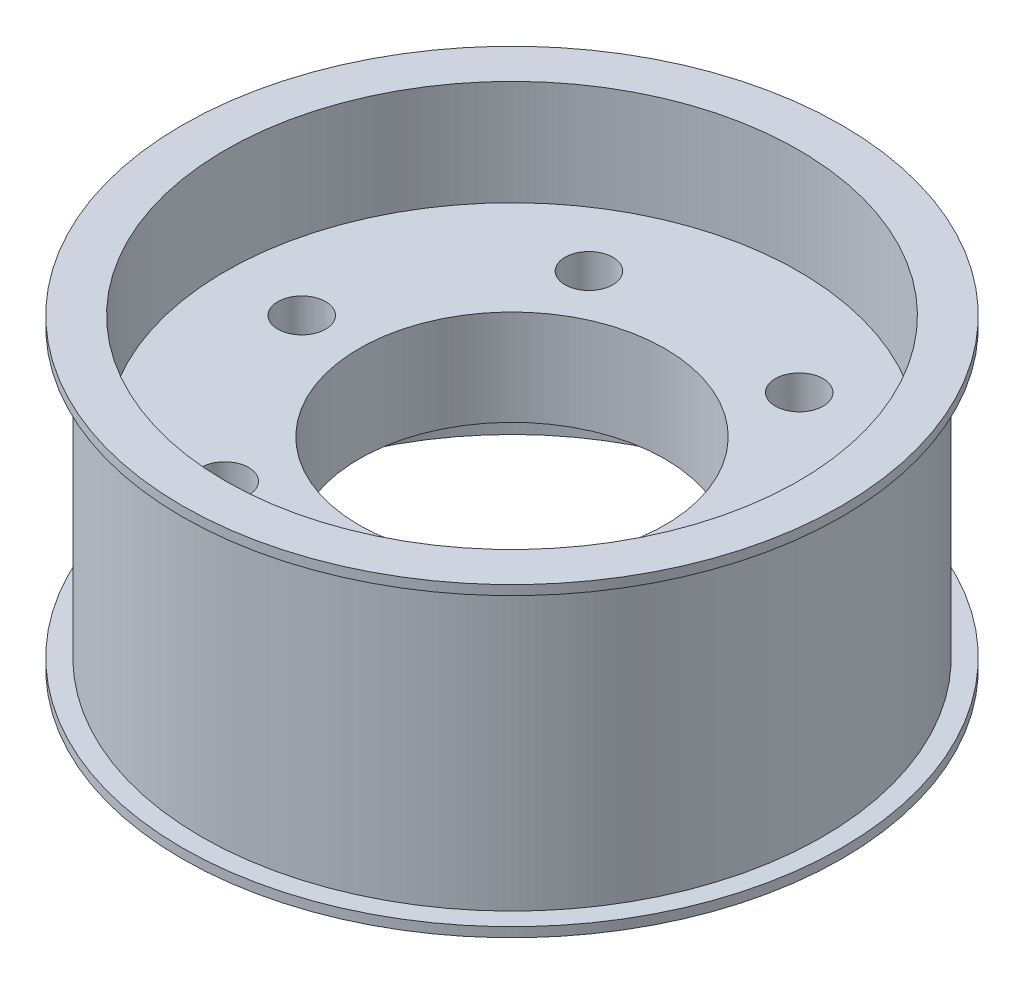
ISO-10303-21;
HEADER;
FILE_DESCRIPTION(('STEP AP214'),'2;1');
FILE_NAME('part.step','',(''),(''),'','','');
FILE_SCHEMA(('AUTOMOTIVE_DESIGN { 1 0 10303 214 1 1 1 1 }'));
ENDSEC;
DATA;
#1=APPLICATION_CONTEXT('core data for automotive mechanical design processes');
#2=APPLICATION_PROTOCOL_DEFINITION('international standard','automotive_design',2000,#1);
#3=PRODUCT_CONTEXT('',#1,'mechanical');
#4=PRODUCT('Part','Part','',(#3));
#5=PRODUCT_RELATED_PRODUCT_CATEGORY('part','',(#4));
#6=PRODUCT_DEFINITION_FORMATION('','',#4);
#7=PRODUCT_DEFINITION_CONTEXT('part definition',#1,'design');
#8=PRODUCT_DEFINITION('design','',#6,#7);
#9=PRODUCT_DEFINITION_SHAPE('','',#8);
#10=(LENGTH_UNIT() NAMED_UNIT(*) SI_UNIT(.MILLI.,.METRE.));
#11=(NAMED_UNIT(*) PLANE_ANGLE_UNIT() SI_UNIT($,.RADIAN.));
#12=(NAMED_UNIT(*) SI_UNIT($,.STERADIAN.) SOLID_ANGLE_UNIT());
#13=UNCERTAINTY_MEASURE_WITH_UNIT(LENGTH_MEASURE(1.E-05),#10,'distance_accuracy_value','');
#14=(GEOMETRIC_REPRESENTATION_CONTEXT(3) GLOBAL_UNCERTAINTY_ASSIGNED_CONTEXT((#13)) GLOBAL_UNIT_ASSIGNED_CONTEXT((#10,
#11,#12)) REPRESENTATION_CONTEXT('',''));
#15=CARTESIAN_POINT('',(0.,0.,0.));
#16=DIRECTION('',(0.,0.,1.));
#17=DIRECTION('',(1.,0.,0.));
#18=AXIS2_PLACEMENT_3D('',#15,#16,#17);
#19=CARTESIAN_POINT('',(17.25,-7.5,0.));
#20=DIRECTION('',(0.,-1.,0.));
#21=DIRECTION('',(0.,0.,-1.));
#22=AXIS2_PLACEMENT_3D('',#19,#20,#21);
#23=PLANE('',#22);
#24=CARTESIAN_POINT('',(0.,-7.5,0.));
#25=DIRECTION('',(0.,1.,0.));
#26=DIRECTION('',(0.,0.,1.));
#27=AXIS2_PLACEMENT_3D('',#24,#25,#26);
#28=CIRCLE('',#27,16.25);
#29=CARTESIAN_POINT('',(0.,-7.5,16.25));
#30=VERTEX_POINT('',#29);
#31=EDGE_CURVE('E10',#30,#30,#28,.T.);
#32=ORIENTED_EDGE('',*,*,#31,.F.);
#33=EDGE_LOOP('',(#32));
#34=FACE_BOUND('',#33,.T.);
#35=CARTESIAN_POINT('',(0.,-7.5,0.));
#36=DIRECTION('',(0.,1.,0.));
#37=DIRECTION('',(0.,0.,1.));
#38=AXIS2_PLACEMENT_3D('',#35,#36,#37);
#39=CIRCLE('',#38,17.25);
#40=CARTESIAN_POINT('',(0.,-7.5,17.25));
#41=VERTEX_POINT('',#40);
#42=EDGE_CURVE('E100',#41,#41,#39,.T.);
#43=ORIENTED_EDGE('',*,*,#42,.T.);
#44=EDGE_LOOP('',(#43));
#45=FACE_BOUND('',#44,.T.);
#46=ADVANCED_FACE('F37',(#34,#45),#23,.F.);
#47=CARTESIAN_POINT('',(0.,8.98299078667611,0.));
#48=DIRECTION('',(0.,1.,0.));
#49=DIRECTION('',(0.,0.,1.));
#50=AXIS2_PLACEMENT_3D('',#47,#48,#49);
#51=CYLINDRICAL_SURFACE('',#50,16.25);
#52=CARTESIAN_POINT('',(0.,7.5,0.));
#53=DIRECTION('',(0.,1.,0.));
#54=DIRECTION('',(0.,0.,1.));
#55=AXIS2_PLACEMENT_3D('',#52,#53,#54);
#56=CIRCLE('',#55,16.25);
#57=CARTESIAN_POINT('',(0.,7.5,16.25));
#58=VERTEX_POINT('',#57);
#59=EDGE_CURVE('E45',#58,#58,#56,.T.);
#60=ORIENTED_EDGE('',*,*,#59,.F.);
#61=EDGE_LOOP('',(#60));
#62=FACE_BOUND('',#61,.T.);
#63=ORIENTED_EDGE('',*,*,#31,.T.);
#64=EDGE_LOOP('',(#63));
#65=FACE_BOUND('',#64,.T.);
#66=ADVANCED_FACE('F136',(#62,#65),#51,.T.);
#67=CARTESIAN_POINT('',(17.25,7.5,0.));
#68=DIRECTION('',(0.,1.,0.));
#69=DIRECTION('',(0.,0.,1.));
#70=AXIS2_PLACEMENT_3D('',#67,#68,#69);
#71=PLANE('',#70);
#72=CARTESIAN_POINT('',(0.,7.5,0.));
#73=DIRECTION('',(0.,1.,0.));
#74=DIRECTION('',(0.,0.,1.));
#75=AXIS2_PLACEMENT_3D('',#72,#73,#74);
#76=CIRCLE('',#75,17.25);
#77=CARTESIAN_POINT('',(0.,7.5,17.25));
#78=VERTEX_POINT('',#77);
#79=EDGE_CURVE('E51',#78,#78,#76,.T.);
#80=ORIENTED_EDGE('',*,*,#79,.F.);
#81=EDGE_LOOP('',(#80));
#82=FACE_BOUND('',#81,.T.);
#83=ORIENTED_EDGE('',*,*,#59,.T.);
#84=EDGE_LOOP('',(#83));
#85=FACE_BOUND('',#84,.T.);
#86=ADVANCED_FACE('F133',(#82,#85),#71,.F.);
#87=CARTESIAN_POINT('',(0.,8.98299078667611,0.));
#88=DIRECTION('',(0.,1.,0.));
#89=DIRECTION('',(0.,0.,1.));
#90=AXIS2_PLACEMENT_3D('',#87,#88,#89);
#91=CYLINDRICAL_SURFACE('',#90,17.25);
#92=CARTESIAN_POINT('',(0.,8.,0.));
#93=DIRECTION('',(0.,1.,0.));
#94=DIRECTION('',(0.,0.,1.));
#95=AXIS2_PLACEMENT_3D('',#92,#93,#94);
#96=CIRCLE('',#95,17.25);
#97=CARTESIAN_POINT('',(0.,8.,17.25));
#98=VERTEX_POINT('',#97);
#99=EDGE_CURVE('E124',#98,#98,#96,.T.);
#100=ORIENTED_EDGE('',*,*,#99,.F.);
#101=EDGE_LOOP('',(#100));
#102=FACE_BOUND('',#101,.T.);
#103=ORIENTED_EDGE('',*,*,#79,.T.);
#104=EDGE_LOOP('',(#103));
#105=FACE_BOUND('',#104,.T.);
#106=ADVANCED_FACE('F131',(#102,#105),#91,.T.);
#107=CARTESIAN_POINT('',(15.,8.,0.));
#108=DIRECTION('',(0.,-1.,0.));
#109=DIRECTION('',(0.,0.,-1.));
#110=AXIS2_PLACEMENT_3D('',#107,#108,#109);
#111=PLANE('',#110);
#112=CARTESIAN_POINT('',(0.,8.,0.));
#113=DIRECTION('',(0.,1.,0.));
#114=DIRECTION('',(0.,0.,1.));
#115=AXIS2_PLACEMENT_3D('',#112,#113,#114);
#116=CIRCLE('',#115,15.);
#117=CARTESIAN_POINT('',(0.,8.,15.));
#118=VERTEX_POINT('',#117);
#119=EDGE_CURVE('E120',#118,#118,#116,.T.);
#120=ORIENTED_EDGE('',*,*,#119,.F.);
#121=EDGE_LOOP('',(#120));
#122=FACE_BOUND('',#121,.T.);
#123=ORIENTED_EDGE('',*,*,#99,.T.);
#124=EDGE_LOOP('',(#123));
#125=FACE_BOUND('',#124,.T.);
#126=ADVANCED_FACE('F148',(#122,#125),#111,.F.);
#127=CARTESIAN_POINT('',(0.,8.98299078667611,0.));
#128=DIRECTION('',(0.,1.,0.));
#129=DIRECTION('',(0.,0.,1.));
#130=AXIS2_PLACEMENT_3D('',#127,#128,#129);
#131=CYLINDRICAL_SURFACE('',#130,15.);
#132=CARTESIAN_POINT('',(0.,2.5,0.));
#133=DIRECTION('',(0.,1.,0.));
#134=DIRECTION('',(0.,0.,1.));
#135=AXIS2_PLACEMENT_3D('',#132,#133,#134);
#136=CIRCLE('',#135,15.);
#137=CARTESIAN_POINT('',(0.,2.5,15.));
#138=VERTEX_POINT('',#137);
#139=EDGE_CURVE('E116',#138,#138,#136,.T.);
#140=ORIENTED_EDGE('',*,*,#139,.F.);
#141=EDGE_LOOP('',(#140));
#142=FACE_BOUND('',#141,.T.);
#143=ORIENTED_EDGE('',*,*,#119,.T.);
#144=EDGE_LOOP('',(#143));
#145=FACE_BOUND('',#144,.T.);
#146=ADVANCED_FACE('F152',(#142,#145),#131,.F.);
#147=CARTESIAN_POINT('',(15.,2.5,0.));
#148=DIRECTION('',(0.,-1.,0.));
#149=DIRECTION('',(0.,0.,-1.));
#150=AXIS2_PLACEMENT_3D('',#147,#148,#149);
#151=PLANE('',#150);
#152=CARTESIAN_POINT('',(11.,2.5,0.));
#153=DIRECTION('',(0.,-1.,0.));
#154=DIRECTION('',(0.,0.,-1.));
#155=AXIS2_PLACEMENT_3D('',#152,#153,#154);
#156=CIRCLE('',#155,1.25);
#157=CARTESIAN_POINT('',(11.,2.5,-1.25));
#158=VERTEX_POINT('',#157);
#159=EDGE_CURVE('E96',#158,#158,#156,.T.);
#160=ORIENTED_EDGE('',*,*,#159,.T.);
#161=EDGE_LOOP('',(#160));
#162=FACE_BOUND('',#161,.T.);
#163=CARTESIAN_POINT('',(-11.,2.5,0.));
#164=DIRECTION('',(0.,-1.,0.));
#165=DIRECTION('',(0.,0.,-1.));
#166=AXIS2_PLACEMENT_3D('',#163,#164,#165);
#167=CIRCLE('',#166,1.25);
#168=CARTESIAN_POINT('',(-11.,2.5,-1.25000000000008));
#169=VERTEX_POINT('',#168);
#170=EDGE_CURVE('E82',#169,#169,#167,.T.);
#171=ORIENTED_EDGE('',*,*,#170,.T.);
#172=EDGE_LOOP('',(#171));
#173=FACE_BOUND('',#172,.T.);
#174=CARTESIAN_POINT('',(-5.50000000000005,2.5,9.5262794416288));
#175=DIRECTION('',(0.,-1.,0.));
#176=DIRECTION('',(0.,0.,-1.));
#177=AXIS2_PLACEMENT_3D('',#174,#175,#176);
#178=CIRCLE('',#177,1.25);
#179=CARTESIAN_POINT('',(-5.50000000000005,2.5,8.2762794416288));
#180=VERTEX_POINT('',#179);
#181=EDGE_CURVE('E78',#180,#180,#178,.T.);
#182=ORIENTED_EDGE('',*,*,#181,.T.);
#183=EDGE_LOOP('',(#182));
#184=FACE_BOUND('',#183,.T.);
#185=CARTESIAN_POINT('',(5.49999999999998,2.5,9.52627944162884));
#186=DIRECTION('',(0.,-1.,0.));
#187=DIRECTION('',(0.,0.,-1.));
#188=AXIS2_PLACEMENT_3D('',#185,#186,#187);
#189=CIRCLE('',#188,1.25);
#190=CARTESIAN_POINT('',(5.49999999999998,2.5,8.27627944162884));
#191=VERTEX_POINT('',#190);
#192=EDGE_CURVE('E74',#191,#191,#189,.T.);
#193=ORIENTED_EDGE('',*,*,#192,.T.);
#194=EDGE_LOOP('',(#193));
#195=FACE_BOUND('',#194,.T.);
#196=CARTESIAN_POINT('',(0.,2.5,0.));
#197=DIRECTION('',(0.,-1.,0.));
#198=DIRECTION('',(0.,0.,-1.));
#199=AXIS2_PLACEMENT_3D('',#196,#197,#198);
#200=CIRCLE('',#199,8.);
#201=CARTESIAN_POINT('',(0.,2.5,-8.));
#202=VERTEX_POINT('',#201);
#203=EDGE_CURVE('E69',#202,#202,#200,.T.);
#204=ORIENTED_EDGE('',*,*,#203,.T.);
#205=EDGE_LOOP('',(#204));
#206=FACE_BOUND('',#205,.T.);
#207=CARTESIAN_POINT('',(-5.49999999999991,2.5,-9.52627944162887));
#208=DIRECTION('',(0.,-1.,0.));
#209=DIRECTION('',(0.,0.,-1.));
#210=AXIS2_PLACEMENT_3D('',#207,#208,#209);
#211=CIRCLE('',#210,1.25);
#212=CARTESIAN_POINT('',(-5.49999999999991,2.5,-10.7762794416289));
#213=VERTEX_POINT('',#212);
#214=EDGE_CURVE('E64',#213,#213,#211,.T.);
#215=ORIENTED_EDGE('',*,*,#214,.T.);
#216=EDGE_LOOP('',(#215));
#217=FACE_BOUND('',#216,.T.);
#218=CARTESIAN_POINT('',(5.50000000000011,2.5,-9.52627944162876));
#219=DIRECTION('',(0.,-1.,0.));
#220=DIRECTION('',(0.,0.,-1.));
#221=AXIS2_PLACEMENT_3D('',#218,#219,#220);
#222=CIRCLE('',#221,1.25);
#223=CARTESIAN_POINT('',(5.50000000000011,2.5,-10.7762794416288));
#224=VERTEX_POINT('',#223);
#225=EDGE_CURVE('E59',#224,#224,#222,.T.);
#226=ORIENTED_EDGE('',*,*,#225,.T.);
#227=EDGE_LOOP('',(#226));
#228=FACE_BOUND('',#227,.T.);
#229=ORIENTED_EDGE('',*,*,#139,.T.);
#230=EDGE_LOOP('',(#229));
#231=FACE_BOUND('',#230,.T.);
#232=ADVANCED_FACE('F156',(#162,#173,#184,#195,#206,#217,#228,#231),#151,.F.);
#233=CARTESIAN_POINT('',(15.,-2.5,0.));
#234=DIRECTION('',(0.,1.,0.));
#235=DIRECTION('',(0.,0.,1.));
#236=AXIS2_PLACEMENT_3D('',#233,#234,#235);
#237=PLANE('',#236);
#238=CARTESIAN_POINT('',(11.,-2.5,0.));
#239=DIRECTION('',(0.,1.,0.));
#240=DIRECTION('',(0.,0.,1.));
#241=AXIS2_PLACEMENT_3D('',#238,#239,#240);
#242=CIRCLE('',#241,1.25);
#243=CARTESIAN_POINT('',(11.,-2.5,1.25));
#244=VERTEX_POINT('',#243);
#245=EDGE_CURVE('E40',#244,#244,#242,.T.);
#246=ORIENTED_EDGE('',*,*,#245,.T.);
#247=EDGE_LOOP('',(#246));
#248=FACE_BOUND('',#247,.T.);
#249=CARTESIAN_POINT('',(-11.,-2.5,0.));
#250=DIRECTION('',(0.,1.,0.));
#251=DIRECTION('',(0.,0.,1.));
#252=AXIS2_PLACEMENT_3D('',#249,#250,#251);
#253=CIRCLE('',#252,1.25);
#254=CARTESIAN_POINT('',(-11.,-2.5,1.24999999999992));
#255=VERTEX_POINT('',#254);
#256=EDGE_CURVE('E79',#255,#255,#253,.T.);
#257=ORIENTED_EDGE('',*,*,#256,.T.);
#258=EDGE_LOOP('',(#257));
#259=FACE_BOUND('',#258,.T.);
#260=CARTESIAN_POINT('',(-5.50000000000005,-2.5,9.5262794416288));
#261=DIRECTION('',(0.,1.,0.));
#262=DIRECTION('',(0.,0.,1.));
#263=AXIS2_PLACEMENT_3D('',#260,#261,#262);
#264=CIRCLE('',#263,1.25);
#265=CARTESIAN_POINT('',(-5.50000000000005,-2.5,10.7762794416288));
#266=VERTEX_POINT('',#265);
#267=EDGE_CURVE('E75',#266,#266,#264,.T.);
#268=ORIENTED_EDGE('',*,*,#267,.T.);
#269=EDGE_LOOP('',(#268));
#270=FACE_BOUND('',#269,.T.);
#271=CARTESIAN_POINT('',(5.49999999999998,-2.5,9.52627944162884));
#272=DIRECTION('',(0.,1.,0.));
#273=DIRECTION('',(0.,0.,1.));
#274=AXIS2_PLACEMENT_3D('',#271,#272,#273);
#275=CIRCLE('',#274,1.25);
#276=CARTESIAN_POINT('',(5.49999999999998,-2.5,10.7762794416288));
#277=VERTEX_POINT('',#276);
#278=EDGE_CURVE('E70',#277,#277,#275,.T.);
#279=ORIENTED_EDGE('',*,*,#278,.T.);
#280=EDGE_LOOP('',(#279));
#281=FACE_BOUND('',#280,.T.);
#282=CARTESIAN_POINT('',(0.,-2.5,0.));
#283=DIRECTION('',(0.,1.,0.));
#284=DIRECTION('',(0.,0.,1.));
#285=AXIS2_PLACEMENT_3D('',#282,#283,#284);
#286=CIRCLE('',#285,8.);
#287=CARTESIAN_POINT('',(0.,-2.5,8.));
#288=VERTEX_POINT('',#287);
#289=EDGE_CURVE('E65',#288,#288,#286,.T.);
#290=ORIENTED_EDGE('',*,*,#289,.T.);
#291=EDGE_LOOP('',(#290));
#292=FACE_BOUND('',#291,.T.);
#293=CARTESIAN_POINT('',(-5.49999999999991,-2.5,-9.52627944162887));
#294=DIRECTION('',(0.,1.,0.));
#295=DIRECTION('',(0.,0.,1.));
#296=AXIS2_PLACEMENT_3D('',#293,#294,#295);
#297=CIRCLE('',#296,1.25);
#298=CARTESIAN_POINT('',(-5.49999999999991,-2.5,-8.27627944162887));
#299=VERTEX_POINT('',#298);
#300=EDGE_CURVE('E60',#299,#299,#297,.T.);
#301=ORIENTED_EDGE('',*,*,#300,.T.);
#302=EDGE_LOOP('',(#301));
#303=FACE_BOUND('',#302,.T.);
#304=CARTESIAN_POINT('',(5.50000000000011,-2.5,-9.52627944162876));
#305=DIRECTION('',(0.,1.,0.));
#306=DIRECTION('',(0.,0.,1.));
#307=AXIS2_PLACEMENT_3D('',#304,#305,#306);
#308=CIRCLE('',#307,1.25);
#309=CARTESIAN_POINT('',(5.50000000000011,-2.5,-8.27627944162876));
#310=VERTEX_POINT('',#309);
#311=EDGE_CURVE('E55',#310,#310,#308,.T.);
#312=ORIENTED_EDGE('',*,*,#311,.T.);
#313=EDGE_LOOP('',(#312));
#314=FACE_BOUND('',#313,.T.);
#315=CARTESIAN_POINT('',(0.,-2.5,0.));
#316=DIRECTION('',(0.,1.,0.));
#317=DIRECTION('',(0.,0.,1.));
#318=AXIS2_PLACEMENT_3D('',#315,#316,#317);
#319=CIRCLE('',#318,15.);
#320=CARTESIAN_POINT('',(0.,-2.5,15.));
#321=VERTEX_POINT('',#320);
#322=EDGE_CURVE('E112',#321,#321,#319,.T.);
#323=ORIENTED_EDGE('',*,*,#322,.F.);
#324=EDGE_LOOP('',(#323));
#325=FACE_BOUND('',#324,.T.);
#326=ADVANCED_FACE('F160',(#248,#259,#270,#281,#292,#303,#314,#325),#237,.F.);
#327=CARTESIAN_POINT('',(0.,8.98299078667611,0.));
#328=DIRECTION('',(0.,1.,0.));
#329=DIRECTION('',(0.,0.,1.));
#330=AXIS2_PLACEMENT_3D('',#327,#328,#329);
#331=CYLINDRICAL_SURFACE('',#330,15.);
#332=CARTESIAN_POINT('',(0.,-8.,0.));
#333=DIRECTION('',(0.,1.,0.));
#334=DIRECTION('',(0.,0.,1.));
#335=AXIS2_PLACEMENT_3D('',#332,#333,#334);
#336=CIRCLE('',#335,15.);
#337=CARTESIAN_POINT('',(0.,-8.,15.));
#338=VERTEX_POINT('',#337);
#339=EDGE_CURVE('E108',#338,#338,#336,.T.);
#340=ORIENTED_EDGE('',*,*,#339,.F.);
#341=EDGE_LOOP('',(#340));
#342=FACE_BOUND('',#341,.T.);
#343=ORIENTED_EDGE('',*,*,#322,.T.);
#344=EDGE_LOOP('',(#343));
#345=FACE_BOUND('',#344,.T.);
#346=ADVANCED_FACE('F164',(#342,#345),#331,.F.);
#347=CARTESIAN_POINT('',(15.,-8.,0.));
#348=DIRECTION('',(0.,1.,0.));
#349=DIRECTION('',(0.,0.,1.));
#350=AXIS2_PLACEMENT_3D('',#347,#348,#349);
#351=PLANE('',#350);
#352=CARTESIAN_POINT('',(0.,-8.,0.));
#353=DIRECTION('',(0.,1.,0.));
#354=DIRECTION('',(0.,0.,1.));
#355=AXIS2_PLACEMENT_3D('',#352,#353,#354);
#356=CIRCLE('',#355,17.25);
#357=CARTESIAN_POINT('',(0.,-8.,17.25));
#358=VERTEX_POINT('',#357);
#359=EDGE_CURVE('E104',#358,#358,#356,.T.);
#360=ORIENTED_EDGE('',*,*,#359,.F.);
#361=EDGE_LOOP('',(#360));
#362=FACE_BOUND('',#361,.T.);
#363=ORIENTED_EDGE('',*,*,#339,.T.);
#364=EDGE_LOOP('',(#363));
#365=FACE_BOUND('',#364,.T.);
#366=ADVANCED_FACE('F168',(#362,#365),#351,.F.);
#367=CARTESIAN_POINT('',(0.,8.98299078667611,0.));
#368=DIRECTION('',(0.,1.,0.));
#369=DIRECTION('',(0.,0.,1.));
#370=AXIS2_PLACEMENT_3D('',#367,#368,#369);
#371=CYLINDRICAL_SURFACE('',#370,17.25);
#372=ORIENTED_EDGE('',*,*,#42,.F.);
#373=EDGE_LOOP('',(#372));
#374=FACE_BOUND('',#373,.T.);
#375=ORIENTED_EDGE('',*,*,#359,.T.);
#376=EDGE_LOOP('',(#375));
#377=FACE_BOUND('',#376,.T.);
#378=ADVANCED_FACE('F172',(#374,#377),#371,.T.);
#379=CARTESIAN_POINT('',(5.50000000000011,-7.5,-9.52627944162876));
#380=DIRECTION('',(0.,1.,0.));
#381=DIRECTION('',(0.,0.,1.));
#382=AXIS2_PLACEMENT_3D('',#379,#380,#381);
#383=CYLINDRICAL_SURFACE('',#382,1.25);
#384=ORIENTED_EDGE('',*,*,#311,.F.);
#385=EDGE_LOOP('',(#384));
#386=FACE_BOUND('',#385,.T.);
#387=ORIENTED_EDGE('',*,*,#225,.F.);
#388=EDGE_LOOP('',(#387));
#389=FACE_BOUND('',#388,.T.);
#390=ADVANCED_FACE('F176',(#386,#389),#383,.F.);
#391=CARTESIAN_POINT('',(-5.49999999999991,-7.5,-9.52627944162887));
#392=DIRECTION('',(0.,1.,0.));
#393=DIRECTION('',(0.,0.,1.));
#394=AXIS2_PLACEMENT_3D('',#391,#392,#393);
#395=CYLINDRICAL_SURFACE('',#394,1.25);
#396=ORIENTED_EDGE('',*,*,#300,.F.);
#397=EDGE_LOOP('',(#396));
#398=FACE_BOUND('',#397,.T.);
#399=ORIENTED_EDGE('',*,*,#214,.F.);
#400=EDGE_LOOP('',(#399));
#401=FACE_BOUND('',#400,.T.);
#402=ADVANCED_FACE('F180',(#398,#401),#395,.F.);
#403=CARTESIAN_POINT('',(0.,-7.5,0.));
#404=DIRECTION('',(0.,1.,0.));
#405=DIRECTION('',(0.,0.,1.));
#406=AXIS2_PLACEMENT_3D('',#403,#404,#405);
#407=CYLINDRICAL_SURFACE('',#406,8.);
#408=ORIENTED_EDGE('',*,*,#289,.F.);
#409=EDGE_LOOP('',(#408));
#410=FACE_BOUND('',#409,.T.);
#411=ORIENTED_EDGE('',*,*,#203,.F.);
#412=EDGE_LOOP('',(#411));
#413=FACE_BOUND('',#412,.T.);
#414=ADVANCED_FACE('F184',(#410,#413),#407,.F.);
#415=CARTESIAN_POINT('',(5.49999999999998,-7.5,9.52627944162884));
#416=DIRECTION('',(0.,1.,0.));
#417=DIRECTION('',(0.,0.,1.));
#418=AXIS2_PLACEMENT_3D('',#415,#416,#417);
#419=CYLINDRICAL_SURFACE('',#418,1.25);
#420=ORIENTED_EDGE('',*,*,#278,.F.);
#421=EDGE_LOOP('',(#420));
#422=FACE_BOUND('',#421,.T.);
#423=ORIENTED_EDGE('',*,*,#192,.F.);
#424=EDGE_LOOP('',(#423));
#425=FACE_BOUND('',#424,.T.);
#426=ADVANCED_FACE('F186',(#422,#425),#419,.F.);
#427=CARTESIAN_POINT('',(-5.50000000000005,-7.5,9.5262794416288));
#428=DIRECTION('',(0.,1.,0.));
#429=DIRECTION('',(0.,0.,1.));
#430=AXIS2_PLACEMENT_3D('',#427,#428,#429);
#431=CYLINDRICAL_SURFACE('',#430,1.25);
#432=ORIENTED_EDGE('',*,*,#267,.F.);
#433=EDGE_LOOP('',(#432));
#434=FACE_BOUND('',#433,.T.);
#435=ORIENTED_EDGE('',*,*,#181,.F.);
#436=EDGE_LOOP('',(#435));
#437=FACE_BOUND('',#436,.T.);
#438=ADVANCED_FACE('F189',(#434,#437),#431,.F.);
#439=CARTESIAN_POINT('',(-11.,-7.5,0.));
#440=DIRECTION('',(0.,1.,0.));
#441=DIRECTION('',(0.,0.,1.));
#442=AXIS2_PLACEMENT_3D('',#439,#440,#441);
#443=CYLINDRICAL_SURFACE('',#442,1.25);
#444=ORIENTED_EDGE('',*,*,#256,.F.);
#445=EDGE_LOOP('',(#444));
#446=FACE_BOUND('',#445,.T.);
#447=ORIENTED_EDGE('',*,*,#170,.F.);
#448=EDGE_LOOP('',(#447));
#449=FACE_BOUND('',#448,.T.);
#450=ADVANCED_FACE('F194',(#446,#449),#443,.F.);
#451=CARTESIAN_POINT('',(11.,-7.5,0.));
#452=DIRECTION('',(0.,1.,0.));
#453=DIRECTION('',(0.,0.,1.));
#454=AXIS2_PLACEMENT_3D('',#451,#452,#453);
#455=CYLINDRICAL_SURFACE('',#454,1.25);
#456=ORIENTED_EDGE('',*,*,#245,.F.);
#457=EDGE_LOOP('',(#456));
#458=FACE_BOUND('',#457,.T.);
#459=ORIENTED_EDGE('',*,*,#159,.F.);
#460=EDGE_LOOP('',(#459));
#461=FACE_BOUND('',#460,.T.);
#462=ADVANCED_FACE('F197',(#458,#461),#455,.F.);
#463=CLOSED_SHELL('',(#46,#66,#86,#106,#126,#146,#232,#326,#346,#366,#378,#390,#402,#414,#426,
#438,#450,#462));
#464=MANIFOLD_SOLID_BREP('B2',#463);
#465=ADVANCED_BREP_SHAPE_REPRESENTATION('',(#18,#464),#14);
#466=SHAPE_DEFINITION_REPRESENTATION(#9,#465);
ENDSEC;
END-ISO-10303-21;
